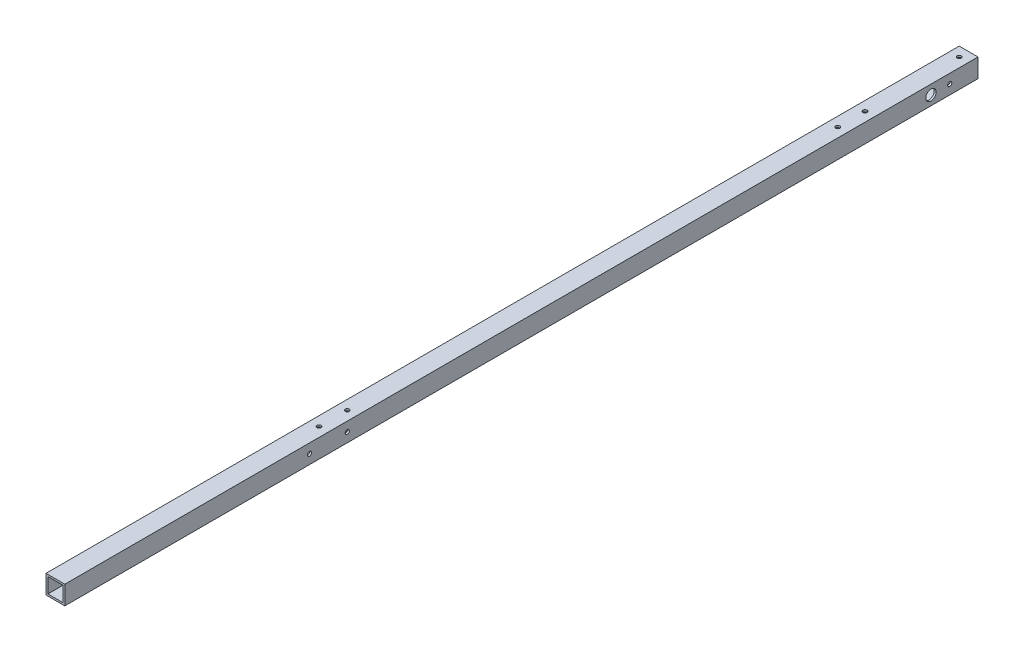
ISO-10303-21;
HEADER;
FILE_DESCRIPTION(('STEP AP214'),'2;1');
FILE_NAME('part.step','',(''),(''),'','','');
FILE_SCHEMA(('AUTOMOTIVE_DESIGN { 1 0 10303 214 1 1 1 1 }'));
ENDSEC;
DATA;
#1=APPLICATION_CONTEXT('core data for automotive mechanical design processes');
#2=APPLICATION_PROTOCOL_DEFINITION('international standard','automotive_design',2000,#1);
#3=PRODUCT_CONTEXT('',#1,'mechanical');
#4=PRODUCT('Part','Part','',(#3));
#5=PRODUCT_RELATED_PRODUCT_CATEGORY('part','',(#4));
#6=PRODUCT_DEFINITION_FORMATION('','',#4);
#7=PRODUCT_DEFINITION_CONTEXT('part definition',#1,'design');
#8=PRODUCT_DEFINITION('design','',#6,#7);
#9=PRODUCT_DEFINITION_SHAPE('','',#8);
#10=(LENGTH_UNIT() NAMED_UNIT(*) SI_UNIT(.MILLI.,.METRE.));
#11=(NAMED_UNIT(*) PLANE_ANGLE_UNIT() SI_UNIT($,.RADIAN.));
#12=(NAMED_UNIT(*) SI_UNIT($,.STERADIAN.) SOLID_ANGLE_UNIT());
#13=UNCERTAINTY_MEASURE_WITH_UNIT(LENGTH_MEASURE(1.E-05),#10,'distance_accuracy_value','');
#14=(GEOMETRIC_REPRESENTATION_CONTEXT(3) GLOBAL_UNCERTAINTY_ASSIGNED_CONTEXT((#13)) GLOBAL_UNIT_ASSIGNED_CONTEXT((#10,
#11,#12)) REPRESENTATION_CONTEXT('',''));
#15=CARTESIAN_POINT('',(0.,0.,0.));
#16=DIRECTION('',(0.,0.,1.));
#17=DIRECTION('',(1.,0.,0.));
#18=AXIS2_PLACEMENT_3D('',#15,#16,#17);
#19=CARTESIAN_POINT('',(0.,0.,970.));
#20=DIRECTION('',(0.,0.,1.));
#21=DIRECTION('',(1.,0.,0.));
#22=AXIS2_PLACEMENT_3D('',#19,#20,#21);
#23=PLANE('',#22);
#24=DIRECTION('',(0.,1.,0.));
#25=VECTOR('',#24,1.);
#26=CARTESIAN_POINT('',(10.,10.,970.));
#27=LINE('',#26,#25);
#28=CARTESIAN_POINT('',(10.,-10.,970.));
#29=VERTEX_POINT('',#28);
#30=CARTESIAN_POINT('',(10.,10.,970.));
#31=VERTEX_POINT('',#30);
#32=EDGE_CURVE('E157',#29,#31,#27,.T.);
#33=ORIENTED_EDGE('',*,*,#32,.T.);
#34=DIRECTION('',(-1.,0.,0.));
#35=VECTOR('',#34,1.);
#36=CARTESIAN_POINT('',(-10.,10.,970.));
#37=LINE('',#36,#35);
#38=CARTESIAN_POINT('',(-10.,10.,970.));
#39=VERTEX_POINT('',#38);
#40=EDGE_CURVE('E161',#31,#39,#37,.T.);
#41=ORIENTED_EDGE('',*,*,#40,.T.);
#42=DIRECTION('',(0.,-1.,0.));
#43=VECTOR('',#42,1.);
#44=CARTESIAN_POINT('',(-10.,10.,970.));
#45=LINE('',#44,#43);
#46=CARTESIAN_POINT('',(-10.,-10.,970.));
#47=VERTEX_POINT('',#46);
#48=EDGE_CURVE('E165',#39,#47,#45,.T.);
#49=ORIENTED_EDGE('',*,*,#48,.T.);
#50=DIRECTION('',(1.,0.,0.));
#51=VECTOR('',#50,1.);
#52=CARTESIAN_POINT('',(-10.,-10.,970.));
#53=LINE('',#52,#51);
#54=EDGE_CURVE('E168',#47,#29,#53,.T.);
#55=ORIENTED_EDGE('',*,*,#54,.T.);
#56=EDGE_LOOP('',(#33,#41,#49,#55));
#57=FACE_BOUND('',#56,.T.);
#58=DIRECTION('',(-1.,0.,0.));
#59=VECTOR('',#58,1.);
#60=CARTESIAN_POINT('',(-8.,8.,970.));
#61=LINE('',#60,#59);
#62=CARTESIAN_POINT('',(8.,8.,970.));
#63=VERTEX_POINT('',#62);
#64=CARTESIAN_POINT('',(-8.,8.,970.));
#65=VERTEX_POINT('',#64);
#66=EDGE_CURVE('E116',#63,#65,#61,.T.);
#67=ORIENTED_EDGE('',*,*,#66,.F.);
#68=DIRECTION('',(0.,1.,0.));
#69=VECTOR('',#68,1.);
#70=CARTESIAN_POINT('',(8.,8.,970.));
#71=LINE('',#70,#69);
#72=CARTESIAN_POINT('',(8.,-8.,970.));
#73=VERTEX_POINT('',#72);
#74=EDGE_CURVE('E107',#73,#63,#71,.T.);
#75=ORIENTED_EDGE('',*,*,#74,.F.);
#76=DIRECTION('',(1.,0.,0.));
#77=VECTOR('',#76,1.);
#78=CARTESIAN_POINT('',(-8.,-8.,970.));
#79=LINE('',#78,#77);
#80=CARTESIAN_POINT('',(-8.,-8.,970.));
#81=VERTEX_POINT('',#80);
#82=EDGE_CURVE('E133',#81,#73,#79,.T.);
#83=ORIENTED_EDGE('',*,*,#82,.F.);
#84=DIRECTION('',(0.,-1.,0.));
#85=VECTOR('',#84,1.);
#86=CARTESIAN_POINT('',(-8.,8.,970.));
#87=LINE('',#86,#85);
#88=EDGE_CURVE('E129',#65,#81,#87,.T.);
#89=ORIENTED_EDGE('',*,*,#88,.F.);
#90=EDGE_LOOP('',(#67,#75,#83,#89));
#91=FACE_BOUND('',#90,.T.);
#92=ADVANCED_FACE('F39',(#57,#91),#23,.T.);
#93=CARTESIAN_POINT('',(0.,0.,0.));
#94=DIRECTION('',(0.,0.,1.));
#95=DIRECTION('',(1.,0.,0.));
#96=AXIS2_PLACEMENT_3D('',#93,#94,#95);
#97=PLANE('',#96);
#98=DIRECTION('',(0.,1.,0.));
#99=VECTOR('',#98,1.);
#100=CARTESIAN_POINT('',(10.,10.,0.));
#101=LINE('',#100,#99);
#102=CARTESIAN_POINT('',(10.,-10.,0.));
#103=VERTEX_POINT('',#102);
#104=CARTESIAN_POINT('',(10.,10.,0.));
#105=VERTEX_POINT('',#104);
#106=EDGE_CURVE('E125',#103,#105,#101,.T.);
#107=ORIENTED_EDGE('',*,*,#106,.F.);
#108=DIRECTION('',(1.,0.,0.));
#109=VECTOR('',#108,1.);
#110=CARTESIAN_POINT('',(-10.,-10.,0.));
#111=LINE('',#110,#109);
#112=CARTESIAN_POINT('',(-10.,-10.,0.));
#113=VERTEX_POINT('',#112);
#114=EDGE_CURVE('E162',#113,#103,#111,.T.);
#115=ORIENTED_EDGE('',*,*,#114,.F.);
#116=DIRECTION('',(0.,-1.,0.));
#117=VECTOR('',#116,1.);
#118=CARTESIAN_POINT('',(-10.,10.,0.));
#119=LINE('',#118,#117);
#120=CARTESIAN_POINT('',(-10.,10.,0.));
#121=VERTEX_POINT('',#120);
#122=EDGE_CURVE('E178',#121,#113,#119,.T.);
#123=ORIENTED_EDGE('',*,*,#122,.F.);
#124=DIRECTION('',(-1.,0.,0.));
#125=VECTOR('',#124,1.);
#126=CARTESIAN_POINT('',(-10.,10.,0.));
#127=LINE('',#126,#125);
#128=EDGE_CURVE('E175',#105,#121,#127,.T.);
#129=ORIENTED_EDGE('',*,*,#128,.F.);
#130=EDGE_LOOP('',(#107,#115,#123,#129));
#131=FACE_BOUND('',#130,.T.);
#132=DIRECTION('',(0.,1.,0.));
#133=VECTOR('',#132,1.);
#134=CARTESIAN_POINT('',(8.,8.,0.));
#135=LINE('',#134,#133);
#136=CARTESIAN_POINT('',(8.,-8.,0.));
#137=VERTEX_POINT('',#136);
#138=CARTESIAN_POINT('',(8.,8.,0.));
#139=VERTEX_POINT('',#138);
#140=EDGE_CURVE('E65',#137,#139,#135,.T.);
#141=ORIENTED_EDGE('',*,*,#140,.T.);
#142=DIRECTION('',(-1.,0.,0.));
#143=VECTOR('',#142,1.);
#144=CARTESIAN_POINT('',(-8.,8.,0.));
#145=LINE('',#144,#143);
#146=CARTESIAN_POINT('',(-8.,8.,0.));
#147=VERTEX_POINT('',#146);
#148=EDGE_CURVE('E123',#139,#147,#145,.T.);
#149=ORIENTED_EDGE('',*,*,#148,.T.);
#150=DIRECTION('',(0.,-1.,0.));
#151=VECTOR('',#150,1.);
#152=CARTESIAN_POINT('',(-8.,8.,0.));
#153=LINE('',#152,#151);
#154=CARTESIAN_POINT('',(-8.,-8.,0.));
#155=VERTEX_POINT('',#154);
#156=EDGE_CURVE('E144',#147,#155,#153,.T.);
#157=ORIENTED_EDGE('',*,*,#156,.T.);
#158=DIRECTION('',(1.,0.,0.));
#159=VECTOR('',#158,1.);
#160=CARTESIAN_POINT('',(-8.,-8.,0.));
#161=LINE('',#160,#159);
#162=EDGE_CURVE('E117',#155,#137,#161,.T.);
#163=ORIENTED_EDGE('',*,*,#162,.T.);
#164=EDGE_LOOP('',(#141,#149,#157,#163));
#165=FACE_BOUND('',#164,.T.);
#166=ADVANCED_FACE('F362',(#131,#165),#97,.F.);
#167=CARTESIAN_POINT('',(10.,10.,970.));
#168=DIRECTION('',(-1.,0.,0.));
#169=DIRECTION('',(0.,0.,1.));
#170=AXIS2_PLACEMENT_3D('',#167,#168,#169);
#171=PLANE('',#170);
#172=CARTESIAN_POINT('',(10.,0.,710.));
#173=DIRECTION('',(1.,0.,0.));
#174=DIRECTION('',(0.,0.,-1.));
#175=AXIS2_PLACEMENT_3D('',#172,#173,#174);
#176=CIRCLE('',#175,2.19999999999998);
#177=CARTESIAN_POINT('',(10.,0.,707.8));
#178=VERTEX_POINT('',#177);
#179=EDGE_CURVE('E198',#178,#178,#176,.T.);
#180=ORIENTED_EDGE('',*,*,#179,.F.);
#181=EDGE_LOOP('',(#180));
#182=FACE_BOUND('',#181,.T.);
#183=CARTESIAN_POINT('',(10.,0.,49.9999999999999));
#184=DIRECTION('',(1.,0.,0.));
#185=DIRECTION('',(0.,0.,-1.));
#186=AXIS2_PLACEMENT_3D('',#183,#184,#185);
#187=CIRCLE('',#186,5.5);
#188=CARTESIAN_POINT('',(10.,0.,44.4999999999999));
#189=VERTEX_POINT('',#188);
#190=EDGE_CURVE('E296',#189,#189,#187,.T.);
#191=ORIENTED_EDGE('',*,*,#190,.F.);
#192=EDGE_LOOP('',(#191));
#193=FACE_BOUND('',#192,.T.);
#194=CARTESIAN_POINT('',(10.,0.,29.9999999999999));
#195=DIRECTION('',(1.,0.,0.));
#196=DIRECTION('',(0.,0.,-1.));
#197=AXIS2_PLACEMENT_3D('',#194,#195,#196);
#198=CIRCLE('',#197,2.2);
#199=CARTESIAN_POINT('',(10.,0.,27.7999999999999));
#200=VERTEX_POINT('',#199);
#201=EDGE_CURVE('E304',#200,#200,#198,.T.);
#202=ORIENTED_EDGE('',*,*,#201,.F.);
#203=EDGE_LOOP('',(#202));
#204=FACE_BOUND('',#203,.T.);
#205=CARTESIAN_POINT('',(10.,0.,670.));
#206=DIRECTION('',(1.,0.,0.));
#207=DIRECTION('',(0.,0.,-1.));
#208=AXIS2_PLACEMENT_3D('',#205,#206,#207);
#209=CIRCLE('',#208,2.19999999999998);
#210=CARTESIAN_POINT('',(10.,0.,667.8));
#211=VERTEX_POINT('',#210);
#212=EDGE_CURVE('E300',#211,#211,#209,.T.);
#213=ORIENTED_EDGE('',*,*,#212,.F.);
#214=EDGE_LOOP('',(#213));
#215=FACE_BOUND('',#214,.T.);
#216=ORIENTED_EDGE('',*,*,#106,.T.);
#217=DIRECTION('',(0.,0.,-1.));
#218=VECTOR('',#217,1.);
#219=CARTESIAN_POINT('',(10.,10.,970.));
#220=LINE('',#219,#218);
#221=EDGE_CURVE('E11',#31,#105,#220,.T.);
#222=ORIENTED_EDGE('',*,*,#221,.F.);
#223=ORIENTED_EDGE('',*,*,#32,.F.);
#224=DIRECTION('',(0.,0.,-1.));
#225=VECTOR('',#224,1.);
#226=CARTESIAN_POINT('',(10.,-10.,970.));
#227=LINE('',#226,#225);
#228=EDGE_CURVE('E171',#29,#103,#227,.T.);
#229=ORIENTED_EDGE('',*,*,#228,.T.);
#230=EDGE_LOOP('',(#216,#222,#223,#229));
#231=FACE_BOUND('',#230,.T.);
#232=ADVANCED_FACE('F41',(#182,#193,#204,#215,#231),#171,.F.);
#233=CARTESIAN_POINT('',(-10.,10.,970.));
#234=DIRECTION('',(0.,-1.,0.));
#235=DIRECTION('',(1.,0.,0.));
#236=AXIS2_PLACEMENT_3D('',#233,#234,#235);
#237=PLANE('',#236);
#238=CARTESIAN_POINT('',(0.,10.,110.));
#239=DIRECTION('',(0.,1.,0.));
#240=DIRECTION('',(-1.,0.,0.));
#241=AXIS2_PLACEMENT_3D('',#238,#239,#240);
#242=CIRCLE('',#241,2.2);
#243=CARTESIAN_POINT('',(-2.19999999999999,10.,110.));
#244=VERTEX_POINT('',#243);
#245=EDGE_CURVE('E238',#244,#244,#242,.T.);
#246=ORIENTED_EDGE('',*,*,#245,.F.);
#247=EDGE_LOOP('',(#246));
#248=FACE_BOUND('',#247,.T.);
#249=CARTESIAN_POINT('',(0.,10.,139.));
#250=DIRECTION('',(0.,1.,0.));
#251=DIRECTION('',(-1.,0.,0.));
#252=AXIS2_PLACEMENT_3D('',#249,#250,#251);
#253=CIRCLE('',#252,2.2);
#254=CARTESIAN_POINT('',(-2.2,10.,139.));
#255=VERTEX_POINT('',#254);
#256=EDGE_CURVE('E247',#255,#255,#253,.T.);
#257=ORIENTED_EDGE('',*,*,#256,.F.);
#258=EDGE_LOOP('',(#257));
#259=FACE_BOUND('',#258,.T.);
#260=CARTESIAN_POINT('',(0.,10.,9.9999999999999));
#261=DIRECTION('',(0.,1.,0.));
#262=DIRECTION('',(-1.,0.,0.));
#263=AXIS2_PLACEMENT_3D('',#260,#261,#262);
#264=CIRCLE('',#263,2.2);
#265=CARTESIAN_POINT('',(-2.2,10.,9.9999999999999));
#266=VERTEX_POINT('',#265);
#267=EDGE_CURVE('E222',#266,#266,#264,.T.);
#268=ORIENTED_EDGE('',*,*,#267,.F.);
#269=EDGE_LOOP('',(#268));
#270=FACE_BOUND('',#269,.T.);
#271=CARTESIAN_POINT('',(0.,10.,660.));
#272=DIRECTION('',(0.,1.,0.));
#273=DIRECTION('',(-1.,0.,0.));
#274=AXIS2_PLACEMENT_3D('',#271,#272,#273);
#275=CIRCLE('',#274,2.19999999999999);
#276=CARTESIAN_POINT('',(-2.19999999999999,10.,660.));
#277=VERTEX_POINT('',#276);
#278=EDGE_CURVE('E270',#277,#277,#275,.T.);
#279=ORIENTED_EDGE('',*,*,#278,.F.);
#280=EDGE_LOOP('',(#279));
#281=FACE_BOUND('',#280,.T.);
#282=CARTESIAN_POINT('',(0.,10.,690.));
#283=DIRECTION('',(0.,1.,0.));
#284=DIRECTION('',(-1.,0.,0.));
#285=AXIS2_PLACEMENT_3D('',#282,#283,#284);
#286=CIRCLE('',#285,2.19999999999999);
#287=CARTESIAN_POINT('',(-2.19999999999999,10.,690.));
#288=VERTEX_POINT('',#287);
#289=EDGE_CURVE('E266',#288,#288,#286,.T.);
#290=ORIENTED_EDGE('',*,*,#289,.F.);
#291=EDGE_LOOP('',(#290));
#292=FACE_BOUND('',#291,.T.);
#293=ORIENTED_EDGE('',*,*,#128,.T.);
#294=DIRECTION('',(0.,0.,-1.));
#295=VECTOR('',#294,1.);
#296=CARTESIAN_POINT('',(-10.,10.,970.));
#297=LINE('',#296,#295);
#298=EDGE_CURVE('E49',#39,#121,#297,.T.);
#299=ORIENTED_EDGE('',*,*,#298,.F.);
#300=ORIENTED_EDGE('',*,*,#40,.F.);
#301=ORIENTED_EDGE('',*,*,#221,.T.);
#302=EDGE_LOOP('',(#293,#299,#300,#301));
#303=FACE_BOUND('',#302,.T.);
#304=ADVANCED_FACE('F378',(#248,#259,#270,#281,#292,#303),#237,.F.);
#305=CARTESIAN_POINT('',(-10.,10.,970.));
#306=DIRECTION('',(1.,0.,0.));
#307=DIRECTION('',(0.,0.,-1.));
#308=AXIS2_PLACEMENT_3D('',#305,#306,#307);
#309=PLANE('',#308);
#310=CARTESIAN_POINT('',(-10.,0.,710.));
#311=DIRECTION('',(1.,0.,0.));
#312=DIRECTION('',(0.,0.,-1.));
#313=AXIS2_PLACEMENT_3D('',#310,#311,#312);
#314=CIRCLE('',#313,2.19999999999998);
#315=CARTESIAN_POINT('',(-10.,0.,707.8));
#316=VERTEX_POINT('',#315);
#317=EDGE_CURVE('E141',#316,#316,#314,.T.);
#318=ORIENTED_EDGE('',*,*,#317,.T.);
#319=EDGE_LOOP('',(#318));
#320=FACE_BOUND('',#319,.T.);
#321=CARTESIAN_POINT('',(-10.,0.,49.9999999999999));
#322=DIRECTION('',(1.,0.,0.));
#323=DIRECTION('',(0.,0.,-1.));
#324=AXIS2_PLACEMENT_3D('',#321,#322,#323);
#325=CIRCLE('',#324,5.5);
#326=CARTESIAN_POINT('',(-10.,0.,44.4999999999999));
#327=VERTEX_POINT('',#326);
#328=EDGE_CURVE('E216',#327,#327,#325,.T.);
#329=ORIENTED_EDGE('',*,*,#328,.T.);
#330=EDGE_LOOP('',(#329));
#331=FACE_BOUND('',#330,.T.);
#332=CARTESIAN_POINT('',(-10.,0.,29.9999999999999));
#333=DIRECTION('',(1.,0.,0.));
#334=DIRECTION('',(0.,0.,-1.));
#335=AXIS2_PLACEMENT_3D('',#332,#333,#334);
#336=CIRCLE('',#335,2.2);
#337=CARTESIAN_POINT('',(-10.,0.,27.7999999999999));
#338=VERTEX_POINT('',#337);
#339=EDGE_CURVE('E210',#338,#338,#336,.T.);
#340=ORIENTED_EDGE('',*,*,#339,.T.);
#341=EDGE_LOOP('',(#340));
#342=FACE_BOUND('',#341,.T.);
#343=CARTESIAN_POINT('',(-10.,0.,670.));
#344=DIRECTION('',(1.,0.,0.));
#345=DIRECTION('',(0.,0.,-1.));
#346=AXIS2_PLACEMENT_3D('',#343,#344,#345);
#347=CIRCLE('',#346,2.19999999999998);
#348=CARTESIAN_POINT('',(-10.,0.,667.8));
#349=VERTEX_POINT('',#348);
#350=EDGE_CURVE('E204',#349,#349,#347,.T.);
#351=ORIENTED_EDGE('',*,*,#350,.T.);
#352=EDGE_LOOP('',(#351));
#353=FACE_BOUND('',#352,.T.);
#354=ORIENTED_EDGE('',*,*,#122,.T.);
#355=DIRECTION('',(0.,0.,-1.));
#356=VECTOR('',#355,1.);
#357=CARTESIAN_POINT('',(-10.,-10.,970.));
#358=LINE('',#357,#356);
#359=EDGE_CURVE('E186',#47,#113,#358,.T.);
#360=ORIENTED_EDGE('',*,*,#359,.F.);
#361=ORIENTED_EDGE('',*,*,#48,.F.);
#362=ORIENTED_EDGE('',*,*,#298,.T.);
#363=EDGE_LOOP('',(#354,#360,#361,#362));
#364=FACE_BOUND('',#363,.T.);
#365=ADVANCED_FACE('F335',(#320,#331,#342,#353,#364),#309,.F.);
#366=CARTESIAN_POINT('',(-10.,-10.,970.));
#367=DIRECTION('',(0.,1.,0.));
#368=DIRECTION('',(0.,0.,1.));
#369=AXIS2_PLACEMENT_3D('',#366,#367,#368);
#370=PLANE('',#369);
#371=CARTESIAN_POINT('',(0.,-10.,110.));
#372=DIRECTION('',(0.,1.,0.));
#373=DIRECTION('',(0.,0.,1.));
#374=AXIS2_PLACEMENT_3D('',#371,#372,#373);
#375=CIRCLE('',#374,2.2);
#376=CARTESIAN_POINT('',(0.,-10.,112.2));
#377=VERTEX_POINT('',#376);
#378=EDGE_CURVE('E262',#377,#377,#375,.T.);
#379=ORIENTED_EDGE('',*,*,#378,.T.);
#380=EDGE_LOOP('',(#379));
#381=FACE_BOUND('',#380,.T.);
#382=CARTESIAN_POINT('',(0.,-10.,139.));
#383=DIRECTION('',(0.,1.,0.));
#384=DIRECTION('',(0.,0.,1.));
#385=AXIS2_PLACEMENT_3D('',#382,#383,#384);
#386=CIRCLE('',#385,2.2);
#387=CARTESIAN_POINT('',(0.,-10.,141.2));
#388=VERTEX_POINT('',#387);
#389=EDGE_CURVE('E244',#388,#388,#386,.T.);
#390=ORIENTED_EDGE('',*,*,#389,.T.);
#391=EDGE_LOOP('',(#390));
#392=FACE_BOUND('',#391,.T.);
#393=CARTESIAN_POINT('',(0.,-10.,9.9999999999999));
#394=DIRECTION('',(0.,1.,0.));
#395=DIRECTION('',(0.,0.,1.));
#396=AXIS2_PLACEMENT_3D('',#393,#394,#395);
#397=CIRCLE('',#396,2.2);
#398=CARTESIAN_POINT('',(0.,-10.,12.1999999999999));
#399=VERTEX_POINT('',#398);
#400=EDGE_CURVE('E292',#399,#399,#397,.T.);
#401=ORIENTED_EDGE('',*,*,#400,.T.);
#402=EDGE_LOOP('',(#401));
#403=FACE_BOUND('',#402,.T.);
#404=CARTESIAN_POINT('',(0.,-10.,660.));
#405=DIRECTION('',(0.,1.,0.));
#406=DIRECTION('',(0.,0.,1.));
#407=AXIS2_PLACEMENT_3D('',#404,#405,#406);
#408=CIRCLE('',#407,2.19999999999999);
#409=CARTESIAN_POINT('',(0.,-10.,662.2));
#410=VERTEX_POINT('',#409);
#411=EDGE_CURVE('E233',#410,#410,#408,.T.);
#412=ORIENTED_EDGE('',*,*,#411,.T.);
#413=EDGE_LOOP('',(#412));
#414=FACE_BOUND('',#413,.T.);
#415=CARTESIAN_POINT('',(0.,-10.,690.));
#416=DIRECTION('',(0.,1.,0.));
#417=DIRECTION('',(0.,0.,1.));
#418=AXIS2_PLACEMENT_3D('',#415,#416,#417);
#419=CIRCLE('',#418,2.19999999999999);
#420=CARTESIAN_POINT('',(0.,-10.,692.2));
#421=VERTEX_POINT('',#420);
#422=EDGE_CURVE('E228',#421,#421,#419,.T.);
#423=ORIENTED_EDGE('',*,*,#422,.T.);
#424=EDGE_LOOP('',(#423));
#425=FACE_BOUND('',#424,.T.);
#426=ORIENTED_EDGE('',*,*,#114,.T.);
#427=ORIENTED_EDGE('',*,*,#228,.F.);
#428=ORIENTED_EDGE('',*,*,#54,.F.);
#429=ORIENTED_EDGE('',*,*,#359,.T.);
#430=EDGE_LOOP('',(#426,#427,#428,#429));
#431=FACE_BOUND('',#430,.T.);
#432=ADVANCED_FACE('F373',(#381,#392,#403,#414,#425,#431),#370,.F.);
#433=CARTESIAN_POINT('',(8.,8.,970.));
#434=DIRECTION('',(-1.,0.,0.));
#435=DIRECTION('',(0.,-1.,0.));
#436=AXIS2_PLACEMENT_3D('',#433,#434,#435);
#437=PLANE('',#436);
#438=CARTESIAN_POINT('',(8.00000000000001,0.,710.));
#439=DIRECTION('',(-1.,0.,0.));
#440=DIRECTION('',(0.,-1.,0.));
#441=AXIS2_PLACEMENT_3D('',#438,#439,#440);
#442=CIRCLE('',#441,2.19999999999998);
#443=CARTESIAN_POINT('',(8.00000000000001,-2.19999999999998,710.));
#444=VERTEX_POINT('',#443);
#445=EDGE_CURVE('E215',#444,#444,#442,.T.);
#446=ORIENTED_EDGE('',*,*,#445,.F.);
#447=EDGE_LOOP('',(#446));
#448=FACE_BOUND('',#447,.T.);
#449=CARTESIAN_POINT('',(8.00000000000001,0.,49.9999999999999));
#450=DIRECTION('',(-1.,0.,0.));
#451=DIRECTION('',(0.,-1.,0.));
#452=AXIS2_PLACEMENT_3D('',#449,#450,#451);
#453=CIRCLE('',#452,5.5);
#454=CARTESIAN_POINT('',(8.00000000000001,-5.5,49.9999999999999));
#455=VERTEX_POINT('',#454);
#456=EDGE_CURVE('E209',#455,#455,#453,.T.);
#457=ORIENTED_EDGE('',*,*,#456,.F.);
#458=EDGE_LOOP('',(#457));
#459=FACE_BOUND('',#458,.T.);
#460=CARTESIAN_POINT('',(8.00000000000001,0.,29.9999999999999));
#461=DIRECTION('',(-1.,0.,0.));
#462=DIRECTION('',(0.,-1.,0.));
#463=AXIS2_PLACEMENT_3D('',#460,#461,#462);
#464=CIRCLE('',#463,2.2);
#465=CARTESIAN_POINT('',(8.00000000000001,-2.2,29.9999999999999));
#466=VERTEX_POINT('',#465);
#467=EDGE_CURVE('E203',#466,#466,#464,.T.);
#468=ORIENTED_EDGE('',*,*,#467,.F.);
#469=EDGE_LOOP('',(#468));
#470=FACE_BOUND('',#469,.T.);
#471=CARTESIAN_POINT('',(8.00000000000001,0.,670.));
#472=DIRECTION('',(-1.,0.,0.));
#473=DIRECTION('',(0.,-1.,0.));
#474=AXIS2_PLACEMENT_3D('',#471,#472,#473);
#475=CIRCLE('',#474,2.19999999999998);
#476=CARTESIAN_POINT('',(8.00000000000001,-2.19999999999998,670.));
#477=VERTEX_POINT('',#476);
#478=EDGE_CURVE('E197',#477,#477,#475,.T.);
#479=ORIENTED_EDGE('',*,*,#478,.F.);
#480=EDGE_LOOP('',(#479));
#481=FACE_BOUND('',#480,.T.);
#482=ORIENTED_EDGE('',*,*,#140,.F.);
#483=DIRECTION('',(0.,0.,-1.));
#484=VECTOR('',#483,1.);
#485=CARTESIAN_POINT('',(8.,-8.,970.));
#486=LINE('',#485,#484);
#487=EDGE_CURVE('E111',#73,#137,#486,.T.);
#488=ORIENTED_EDGE('',*,*,#487,.F.);
#489=ORIENTED_EDGE('',*,*,#74,.T.);
#490=DIRECTION('',(0.,0.,-1.));
#491=VECTOR('',#490,1.);
#492=CARTESIAN_POINT('',(8.,8.,970.));
#493=LINE('',#492,#491);
#494=EDGE_CURVE('E110',#63,#139,#493,.T.);
#495=ORIENTED_EDGE('',*,*,#494,.T.);
#496=EDGE_LOOP('',(#482,#488,#489,#495));
#497=FACE_BOUND('',#496,.T.);
#498=ADVANCED_FACE('F109',(#448,#459,#470,#481,#497),#437,.T.);
#499=CARTESIAN_POINT('',(-8.,8.,970.));
#500=DIRECTION('',(0.,-1.,0.));
#501=DIRECTION('',(0.,0.,-1.));
#502=AXIS2_PLACEMENT_3D('',#499,#500,#501);
#503=PLANE('',#502);
#504=CARTESIAN_POINT('',(0.,8.,110.));
#505=DIRECTION('',(0.,-1.,0.));
#506=DIRECTION('',(0.,0.,-1.));
#507=AXIS2_PLACEMENT_3D('',#504,#505,#506);
#508=CIRCLE('',#507,2.2);
#509=CARTESIAN_POINT('',(0.,8.,107.8));
#510=VERTEX_POINT('',#509);
#511=EDGE_CURVE('E258',#510,#510,#508,.T.);
#512=ORIENTED_EDGE('',*,*,#511,.F.);
#513=EDGE_LOOP('',(#512));
#514=FACE_BOUND('',#513,.T.);
#515=CARTESIAN_POINT('',(0.,8.,139.));
#516=DIRECTION('',(0.,-1.,0.));
#517=DIRECTION('',(0.,0.,-1.));
#518=AXIS2_PLACEMENT_3D('',#515,#516,#517);
#519=CIRCLE('',#518,2.2);
#520=CARTESIAN_POINT('',(0.,8.,136.8));
#521=VERTEX_POINT('',#520);
#522=EDGE_CURVE('E237',#521,#521,#519,.T.);
#523=ORIENTED_EDGE('',*,*,#522,.F.);
#524=EDGE_LOOP('',(#523));
#525=FACE_BOUND('',#524,.T.);
#526=CARTESIAN_POINT('',(0.,8.00000000000001,9.9999999999999));
#527=DIRECTION('',(0.,-1.,0.));
#528=DIRECTION('',(0.,0.,-1.));
#529=AXIS2_PLACEMENT_3D('',#526,#527,#528);
#530=CIRCLE('',#529,2.2);
#531=CARTESIAN_POINT('',(0.,8.00000000000001,7.7999999999999));
#532=VERTEX_POINT('',#531);
#533=EDGE_CURVE('E232',#532,#532,#530,.T.);
#534=ORIENTED_EDGE('',*,*,#533,.F.);
#535=EDGE_LOOP('',(#534));
#536=FACE_BOUND('',#535,.T.);
#537=CARTESIAN_POINT('',(0.,8.00000000000001,660.));
#538=DIRECTION('',(0.,-1.,0.));
#539=DIRECTION('',(0.,0.,-1.));
#540=AXIS2_PLACEMENT_3D('',#537,#538,#539);
#541=CIRCLE('',#540,2.19999999999999);
#542=CARTESIAN_POINT('',(0.,8.00000000000001,657.8));
#543=VERTEX_POINT('',#542);
#544=EDGE_CURVE('E227',#543,#543,#541,.T.);
#545=ORIENTED_EDGE('',*,*,#544,.F.);
#546=EDGE_LOOP('',(#545));
#547=FACE_BOUND('',#546,.T.);
#548=CARTESIAN_POINT('',(0.,8.00000000000001,690.));
#549=DIRECTION('',(0.,-1.,0.));
#550=DIRECTION('',(0.,0.,-1.));
#551=AXIS2_PLACEMENT_3D('',#548,#549,#550);
#552=CIRCLE('',#551,2.19999999999999);
#553=CARTESIAN_POINT('',(0.,8.00000000000001,687.8));
#554=VERTEX_POINT('',#553);
#555=EDGE_CURVE('E221',#554,#554,#552,.T.);
#556=ORIENTED_EDGE('',*,*,#555,.F.);
#557=EDGE_LOOP('',(#556));
#558=FACE_BOUND('',#557,.T.);
#559=ORIENTED_EDGE('',*,*,#148,.F.);
#560=ORIENTED_EDGE('',*,*,#494,.F.);
#561=ORIENTED_EDGE('',*,*,#66,.T.);
#562=DIRECTION('',(0.,0.,-1.));
#563=VECTOR('',#562,1.);
#564=CARTESIAN_POINT('',(-8.,8.,970.));
#565=LINE('',#564,#563);
#566=EDGE_CURVE('E126',#65,#147,#565,.T.);
#567=ORIENTED_EDGE('',*,*,#566,.T.);
#568=EDGE_LOOP('',(#559,#560,#561,#567));
#569=FACE_BOUND('',#568,.T.);
#570=ADVANCED_FACE('F120',(#514,#525,#536,#547,#558,#569),#503,.T.);
#571=CARTESIAN_POINT('',(-8.,8.,970.));
#572=DIRECTION('',(1.,0.,0.));
#573=DIRECTION('',(0.,0.,-1.));
#574=AXIS2_PLACEMENT_3D('',#571,#572,#573);
#575=PLANE('',#574);
#576=CARTESIAN_POINT('',(-8.00000000000001,0.,710.));
#577=DIRECTION('',(1.,0.,0.));
#578=DIRECTION('',(0.,0.,-1.));
#579=AXIS2_PLACEMENT_3D('',#576,#577,#578);
#580=CIRCLE('',#579,2.19999999999998);
#581=CARTESIAN_POINT('',(-8.00000000000001,0.,707.8));
#582=VERTEX_POINT('',#581);
#583=EDGE_CURVE('E211',#582,#582,#580,.T.);
#584=ORIENTED_EDGE('',*,*,#583,.F.);
#585=EDGE_LOOP('',(#584));
#586=FACE_BOUND('',#585,.T.);
#587=CARTESIAN_POINT('',(-8.00000000000001,0.,49.9999999999999));
#588=DIRECTION('',(1.,0.,0.));
#589=DIRECTION('',(0.,0.,-1.));
#590=AXIS2_PLACEMENT_3D('',#587,#588,#589);
#591=CIRCLE('',#590,5.5);
#592=CARTESIAN_POINT('',(-8.00000000000001,0.,44.4999999999999));
#593=VERTEX_POINT('',#592);
#594=EDGE_CURVE('E205',#593,#593,#591,.T.);
#595=ORIENTED_EDGE('',*,*,#594,.F.);
#596=EDGE_LOOP('',(#595));
#597=FACE_BOUND('',#596,.T.);
#598=CARTESIAN_POINT('',(-8.00000000000001,0.,29.9999999999999));
#599=DIRECTION('',(1.,0.,0.));
#600=DIRECTION('',(0.,0.,-1.));
#601=AXIS2_PLACEMENT_3D('',#598,#599,#600);
#602=CIRCLE('',#601,2.2);
#603=CARTESIAN_POINT('',(-8.00000000000001,0.,27.7999999999999));
#604=VERTEX_POINT('',#603);
#605=EDGE_CURVE('E199',#604,#604,#602,.T.);
#606=ORIENTED_EDGE('',*,*,#605,.F.);
#607=EDGE_LOOP('',(#606));
#608=FACE_BOUND('',#607,.T.);
#609=CARTESIAN_POINT('',(-8.00000000000001,0.,670.));
#610=DIRECTION('',(1.,0.,0.));
#611=DIRECTION('',(0.,0.,-1.));
#612=AXIS2_PLACEMENT_3D('',#609,#610,#611);
#613=CIRCLE('',#612,2.19999999999998);
#614=CARTESIAN_POINT('',(-8.00000000000001,0.,667.8));
#615=VERTEX_POINT('',#614);
#616=EDGE_CURVE('E193',#615,#615,#613,.T.);
#617=ORIENTED_EDGE('',*,*,#616,.F.);
#618=EDGE_LOOP('',(#617));
#619=FACE_BOUND('',#618,.T.);
#620=ORIENTED_EDGE('',*,*,#156,.F.);
#621=ORIENTED_EDGE('',*,*,#566,.F.);
#622=ORIENTED_EDGE('',*,*,#88,.T.);
#623=DIRECTION('',(0.,0.,-1.));
#624=VECTOR('',#623,1.);
#625=CARTESIAN_POINT('',(-8.,-8.,970.));
#626=LINE('',#625,#624);
#627=EDGE_CURVE('E57',#81,#155,#626,.T.);
#628=ORIENTED_EDGE('',*,*,#627,.T.);
#629=EDGE_LOOP('',(#620,#621,#622,#628));
#630=FACE_BOUND('',#629,.T.);
#631=ADVANCED_FACE('F411',(#586,#597,#608,#619,#630),#575,.T.);
#632=CARTESIAN_POINT('',(-8.,-8.,970.));
#633=DIRECTION('',(0.,1.,0.));
#634=DIRECTION('',(0.,0.,1.));
#635=AXIS2_PLACEMENT_3D('',#632,#633,#634);
#636=PLANE('',#635);
#637=CARTESIAN_POINT('',(0.,-8.,110.));
#638=DIRECTION('',(0.,1.,0.));
#639=DIRECTION('',(0.,0.,1.));
#640=AXIS2_PLACEMENT_3D('',#637,#638,#639);
#641=CIRCLE('',#640,2.2);
#642=CARTESIAN_POINT('',(0.,-8.,112.2));
#643=VERTEX_POINT('',#642);
#644=EDGE_CURVE('E43',#643,#643,#641,.T.);
#645=ORIENTED_EDGE('',*,*,#644,.F.);
#646=EDGE_LOOP('',(#645));
#647=FACE_BOUND('',#646,.T.);
#648=CARTESIAN_POINT('',(0.,-8.,139.));
#649=DIRECTION('',(0.,1.,0.));
#650=DIRECTION('',(0.,0.,1.));
#651=AXIS2_PLACEMENT_3D('',#648,#649,#650);
#652=CIRCLE('',#651,2.2);
#653=CARTESIAN_POINT('',(0.,-8.,141.2));
#654=VERTEX_POINT('',#653);
#655=EDGE_CURVE('E234',#654,#654,#652,.T.);
#656=ORIENTED_EDGE('',*,*,#655,.F.);
#657=EDGE_LOOP('',(#656));
#658=FACE_BOUND('',#657,.T.);
#659=CARTESIAN_POINT('',(0.,-8.00000000000001,9.9999999999999));
#660=DIRECTION('',(0.,1.,0.));
#661=DIRECTION('',(0.,0.,1.));
#662=AXIS2_PLACEMENT_3D('',#659,#660,#661);
#663=CIRCLE('',#662,2.2);
#664=CARTESIAN_POINT('',(0.,-8.00000000000001,12.1999999999999));
#665=VERTEX_POINT('',#664);
#666=EDGE_CURVE('E229',#665,#665,#663,.T.);
#667=ORIENTED_EDGE('',*,*,#666,.F.);
#668=EDGE_LOOP('',(#667));
#669=FACE_BOUND('',#668,.T.);
#670=CARTESIAN_POINT('',(0.,-8.00000000000001,660.));
#671=DIRECTION('',(0.,1.,0.));
#672=DIRECTION('',(0.,0.,1.));
#673=AXIS2_PLACEMENT_3D('',#670,#671,#672);
#674=CIRCLE('',#673,2.19999999999999);
#675=CARTESIAN_POINT('',(0.,-8.00000000000001,662.2));
#676=VERTEX_POINT('',#675);
#677=EDGE_CURVE('E223',#676,#676,#674,.T.);
#678=ORIENTED_EDGE('',*,*,#677,.F.);
#679=EDGE_LOOP('',(#678));
#680=FACE_BOUND('',#679,.T.);
#681=CARTESIAN_POINT('',(0.,-8.00000000000001,690.));
#682=DIRECTION('',(0.,1.,0.));
#683=DIRECTION('',(0.,0.,1.));
#684=AXIS2_PLACEMENT_3D('',#681,#682,#683);
#685=CIRCLE('',#684,2.19999999999999);
#686=CARTESIAN_POINT('',(0.,-8.00000000000001,692.2));
#687=VERTEX_POINT('',#686);
#688=EDGE_CURVE('E217',#687,#687,#685,.T.);
#689=ORIENTED_EDGE('',*,*,#688,.F.);
#690=EDGE_LOOP('',(#689));
#691=FACE_BOUND('',#690,.T.);
#692=ORIENTED_EDGE('',*,*,#162,.F.);
#693=ORIENTED_EDGE('',*,*,#627,.F.);
#694=ORIENTED_EDGE('',*,*,#82,.T.);
#695=ORIENTED_EDGE('',*,*,#487,.T.);
#696=EDGE_LOOP('',(#692,#693,#694,#695));
#697=FACE_BOUND('',#696,.T.);
#698=ADVANCED_FACE('F409',(#647,#658,#669,#680,#691,#697),#636,.T.);
#699=CARTESIAN_POINT('',(-960.,0.,670.));
#700=DIRECTION('',(1.,0.,0.));
#701=DIRECTION('',(0.,0.,-1.));
#702=AXIS2_PLACEMENT_3D('',#699,#700,#701);
#703=CYLINDRICAL_SURFACE('',#702,2.19999999999998);
#704=ORIENTED_EDGE('',*,*,#616,.T.);
#705=EDGE_LOOP('',(#704));
#706=FACE_BOUND('',#705,.T.);
#707=ORIENTED_EDGE('',*,*,#350,.F.);
#708=EDGE_LOOP('',(#707));
#709=FACE_BOUND('',#708,.T.);
#710=ADVANCED_FACE('F352',(#706,#709),#703,.F.);
#711=CARTESIAN_POINT('',(-960.,0.,29.9999999999999));
#712=DIRECTION('',(1.,0.,0.));
#713=DIRECTION('',(0.,0.,-1.));
#714=AXIS2_PLACEMENT_3D('',#711,#712,#713);
#715=CYLINDRICAL_SURFACE('',#714,2.2);
#716=ORIENTED_EDGE('',*,*,#605,.T.);
#717=EDGE_LOOP('',(#716));
#718=FACE_BOUND('',#717,.T.);
#719=ORIENTED_EDGE('',*,*,#339,.F.);
#720=EDGE_LOOP('',(#719));
#721=FACE_BOUND('',#720,.T.);
#722=ADVANCED_FACE('F353',(#718,#721),#715,.F.);
#723=CARTESIAN_POINT('',(-960.,0.,49.9999999999999));
#724=DIRECTION('',(1.,0.,0.));
#725=DIRECTION('',(0.,0.,-1.));
#726=AXIS2_PLACEMENT_3D('',#723,#724,#725);
#727=CYLINDRICAL_SURFACE('',#726,5.5);
#728=ORIENTED_EDGE('',*,*,#594,.T.);
#729=EDGE_LOOP('',(#728));
#730=FACE_BOUND('',#729,.T.);
#731=ORIENTED_EDGE('',*,*,#328,.F.);
#732=EDGE_LOOP('',(#731));
#733=FACE_BOUND('',#732,.T.);
#734=ADVANCED_FACE('F341',(#730,#733),#727,.F.);
#735=CARTESIAN_POINT('',(-960.,0.,710.));
#736=DIRECTION('',(1.,0.,0.));
#737=DIRECTION('',(0.,0.,-1.));
#738=AXIS2_PLACEMENT_3D('',#735,#736,#737);
#739=CYLINDRICAL_SURFACE('',#738,2.19999999999998);
#740=ORIENTED_EDGE('',*,*,#583,.T.);
#741=EDGE_LOOP('',(#740));
#742=FACE_BOUND('',#741,.T.);
#743=ORIENTED_EDGE('',*,*,#317,.F.);
#744=EDGE_LOOP('',(#743));
#745=FACE_BOUND('',#744,.T.);
#746=ADVANCED_FACE('F338',(#742,#745),#739,.F.);
#747=ORIENTED_EDGE('',*,*,#478,.T.);
#748=EDGE_LOOP('',(#747));
#749=FACE_BOUND('',#748,.T.);
#750=ORIENTED_EDGE('',*,*,#212,.T.);
#751=EDGE_LOOP('',(#750));
#752=FACE_BOUND('',#751,.T.);
#753=ADVANCED_FACE('F340',(#749,#752),#703,.F.);
#754=ORIENTED_EDGE('',*,*,#467,.T.);
#755=EDGE_LOOP('',(#754));
#756=FACE_BOUND('',#755,.T.);
#757=ORIENTED_EDGE('',*,*,#201,.T.);
#758=EDGE_LOOP('',(#757));
#759=FACE_BOUND('',#758,.T.);
#760=ADVANCED_FACE('F349',(#756,#759),#715,.F.);
#761=ORIENTED_EDGE('',*,*,#456,.T.);
#762=EDGE_LOOP('',(#761));
#763=FACE_BOUND('',#762,.T.);
#764=ORIENTED_EDGE('',*,*,#190,.T.);
#765=EDGE_LOOP('',(#764));
#766=FACE_BOUND('',#765,.T.);
#767=ADVANCED_FACE('F356',(#763,#766),#727,.F.);
#768=ORIENTED_EDGE('',*,*,#445,.T.);
#769=EDGE_LOOP('',(#768));
#770=FACE_BOUND('',#769,.T.);
#771=ORIENTED_EDGE('',*,*,#179,.T.);
#772=EDGE_LOOP('',(#771));
#773=FACE_BOUND('',#772,.T.);
#774=ADVANCED_FACE('F344',(#770,#773),#739,.F.);
#775=CARTESIAN_POINT('',(0.,-960.,690.));
#776=DIRECTION('',(0.,1.,0.));
#777=DIRECTION('',(-1.,0.,0.));
#778=AXIS2_PLACEMENT_3D('',#775,#776,#777);
#779=CYLINDRICAL_SURFACE('',#778,2.19999999999999);
#780=ORIENTED_EDGE('',*,*,#688,.T.);
#781=EDGE_LOOP('',(#780));
#782=FACE_BOUND('',#781,.T.);
#783=ORIENTED_EDGE('',*,*,#422,.F.);
#784=EDGE_LOOP('',(#783));
#785=FACE_BOUND('',#784,.T.);
#786=ADVANCED_FACE('F359',(#782,#785),#779,.F.);
#787=CARTESIAN_POINT('',(0.,-960.,660.));
#788=DIRECTION('',(0.,1.,0.));
#789=DIRECTION('',(-1.,0.,0.));
#790=AXIS2_PLACEMENT_3D('',#787,#788,#789);
#791=CYLINDRICAL_SURFACE('',#790,2.19999999999999);
#792=ORIENTED_EDGE('',*,*,#677,.T.);
#793=EDGE_LOOP('',(#792));
#794=FACE_BOUND('',#793,.T.);
#795=ORIENTED_EDGE('',*,*,#411,.F.);
#796=EDGE_LOOP('',(#795));
#797=FACE_BOUND('',#796,.T.);
#798=ADVANCED_FACE('F452',(#794,#797),#791,.F.);
#799=CARTESIAN_POINT('',(0.,-960.,9.9999999999999));
#800=DIRECTION('',(0.,1.,0.));
#801=DIRECTION('',(-1.,0.,0.));
#802=AXIS2_PLACEMENT_3D('',#799,#800,#801);
#803=CYLINDRICAL_SURFACE('',#802,2.2);
#804=ORIENTED_EDGE('',*,*,#666,.T.);
#805=EDGE_LOOP('',(#804));
#806=FACE_BOUND('',#805,.T.);
#807=ORIENTED_EDGE('',*,*,#400,.F.);
#808=EDGE_LOOP('',(#807));
#809=FACE_BOUND('',#808,.T.);
#810=ADVANCED_FACE('F444',(#806,#809),#803,.F.);
#811=ORIENTED_EDGE('',*,*,#555,.T.);
#812=EDGE_LOOP('',(#811));
#813=FACE_BOUND('',#812,.T.);
#814=ORIENTED_EDGE('',*,*,#289,.T.);
#815=EDGE_LOOP('',(#814));
#816=FACE_BOUND('',#815,.T.);
#817=ADVANCED_FACE('F440',(#813,#816),#779,.F.);
#818=ORIENTED_EDGE('',*,*,#544,.T.);
#819=EDGE_LOOP('',(#818));
#820=FACE_BOUND('',#819,.T.);
#821=ORIENTED_EDGE('',*,*,#278,.T.);
#822=EDGE_LOOP('',(#821));
#823=FACE_BOUND('',#822,.T.);
#824=ADVANCED_FACE('F443',(#820,#823),#791,.F.);
#825=ORIENTED_EDGE('',*,*,#533,.T.);
#826=EDGE_LOOP('',(#825));
#827=FACE_BOUND('',#826,.T.);
#828=ORIENTED_EDGE('',*,*,#267,.T.);
#829=EDGE_LOOP('',(#828));
#830=FACE_BOUND('',#829,.T.);
#831=ADVANCED_FACE('F449',(#827,#830),#803,.F.);
#832=CARTESIAN_POINT('',(0.,-20.,139.));
#833=DIRECTION('',(0.,1.,0.));
#834=DIRECTION('',(-1.,0.,0.));
#835=AXIS2_PLACEMENT_3D('',#832,#833,#834);
#836=CYLINDRICAL_SURFACE('',#835,2.2);
#837=ORIENTED_EDGE('',*,*,#655,.T.);
#838=EDGE_LOOP('',(#837));
#839=FACE_BOUND('',#838,.T.);
#840=ORIENTED_EDGE('',*,*,#389,.F.);
#841=EDGE_LOOP('',(#840));
#842=FACE_BOUND('',#841,.T.);
#843=ADVANCED_FACE('F470',(#839,#842),#836,.F.);
#844=CARTESIAN_POINT('',(0.,-20.,110.));
#845=DIRECTION('',(0.,1.,0.));
#846=DIRECTION('',(-1.,0.,0.));
#847=AXIS2_PLACEMENT_3D('',#844,#845,#846);
#848=CYLINDRICAL_SURFACE('',#847,2.2);
#849=ORIENTED_EDGE('',*,*,#644,.T.);
#850=EDGE_LOOP('',(#849));
#851=FACE_BOUND('',#850,.T.);
#852=ORIENTED_EDGE('',*,*,#378,.F.);
#853=EDGE_LOOP('',(#852));
#854=FACE_BOUND('',#853,.T.);
#855=ADVANCED_FACE('F473',(#851,#854),#848,.F.);
#856=ORIENTED_EDGE('',*,*,#522,.T.);
#857=EDGE_LOOP('',(#856));
#858=FACE_BOUND('',#857,.T.);
#859=ORIENTED_EDGE('',*,*,#256,.T.);
#860=EDGE_LOOP('',(#859));
#861=FACE_BOUND('',#860,.T.);
#862=ADVANCED_FACE('F474',(#858,#861),#836,.F.);
#863=ORIENTED_EDGE('',*,*,#511,.T.);
#864=EDGE_LOOP('',(#863));
#865=FACE_BOUND('',#864,.T.);
#866=ORIENTED_EDGE('',*,*,#245,.T.);
#867=EDGE_LOOP('',(#866));
#868=FACE_BOUND('',#867,.T.);
#869=ADVANCED_FACE('F477',(#865,#868),#848,.F.);
#870=CLOSED_SHELL('',(#92,#166,#232,#304,#365,#432,#498,#570,#631,#698,#710,#722,#734,#746,#753,
#760,#767,#774,#786,#798,#810,#817,#824,#831,#843,#855,#862,#869));
#871=MANIFOLD_SOLID_BREP('B2',#870);
#872=ADVANCED_BREP_SHAPE_REPRESENTATION('',(#18,#871),#14);
#873=SHAPE_DEFINITION_REPRESENTATION(#9,#872);
ENDSEC;
END-ISO-10303-21;
